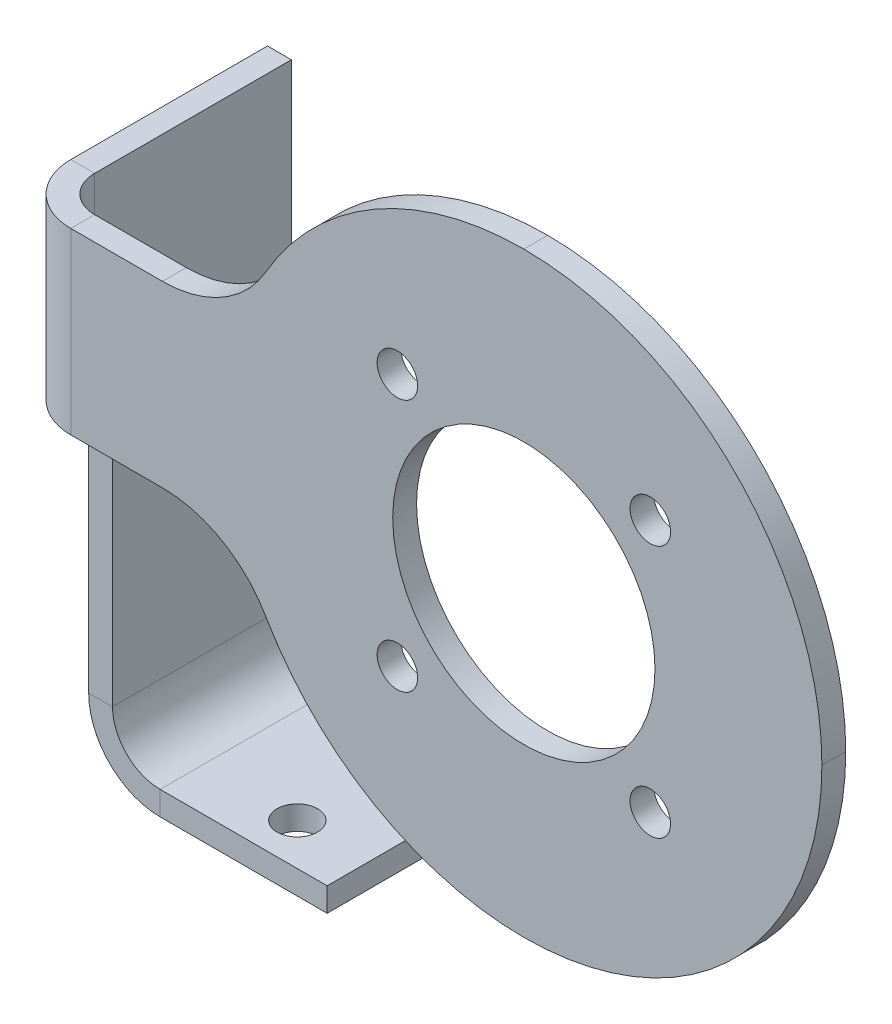
ISO-10303-21;
HEADER;
FILE_DESCRIPTION(('STEP AP214'),'2;1');
FILE_NAME('part.step','',(''),(''),'','','');
FILE_SCHEMA(('AUTOMOTIVE_DESIGN { 1 0 10303 214 1 1 1 1 }'));
ENDSEC;
DATA;
#1=APPLICATION_CONTEXT('core data for automotive mechanical design processes');
#2=APPLICATION_PROTOCOL_DEFINITION('international standard','automotive_design',2000,#1);
#3=PRODUCT_CONTEXT('',#1,'mechanical');
#4=PRODUCT('Part','Part','',(#3));
#5=PRODUCT_RELATED_PRODUCT_CATEGORY('part','',(#4));
#6=PRODUCT_DEFINITION_FORMATION('','',#4);
#7=PRODUCT_DEFINITION_CONTEXT('part definition',#1,'design');
#8=PRODUCT_DEFINITION('design','',#6,#7);
#9=PRODUCT_DEFINITION_SHAPE('','',#8);
#10=(LENGTH_UNIT() NAMED_UNIT(*) SI_UNIT(.MILLI.,.METRE.));
#11=(NAMED_UNIT(*) PLANE_ANGLE_UNIT() SI_UNIT($,.RADIAN.));
#12=(NAMED_UNIT(*) SI_UNIT($,.STERADIAN.) SOLID_ANGLE_UNIT());
#13=UNCERTAINTY_MEASURE_WITH_UNIT(LENGTH_MEASURE(1.E-05),#10,'distance_accuracy_value','');
#14=(GEOMETRIC_REPRESENTATION_CONTEXT(3) GLOBAL_UNCERTAINTY_ASSIGNED_CONTEXT((#13)) GLOBAL_UNIT_ASSIGNED_CONTEXT((#10,
#11,#12)) REPRESENTATION_CONTEXT('',''));
#15=CARTESIAN_POINT('',(0.,0.,0.));
#16=DIRECTION('',(0.,0.,1.));
#17=DIRECTION('',(1.,0.,0.));
#18=AXIS2_PLACEMENT_3D('',#15,#16,#17);
#19=CARTESIAN_POINT('',(-66.,32.5,-21.5));
#20=DIRECTION('',(0.,-1.,0.));
#21=DIRECTION('',(0.,0.,1.));
#22=AXIS2_PLACEMENT_3D('',#19,#20,#21);
#23=PLANE('',#22);
#24=DIRECTION('',(1.,0.,0.));
#25=VECTOR('',#24,1.);
#26=CARTESIAN_POINT('',(-66.,32.5,-21.5));
#27=LINE('',#26,#25);
#28=CARTESIAN_POINT('',(-68.,32.5,-21.5));
#29=VERTEX_POINT('',#28);
#30=CARTESIAN_POINT('',(-66.,32.5,-21.5));
#31=VERTEX_POINT('',#30);
#32=EDGE_CURVE('E14',#29,#31,#27,.T.);
#33=ORIENTED_EDGE('',*,*,#32,.F.);
#34=DIRECTION('',(0.,0.,1.));
#35=VECTOR('',#34,1.);
#36=CARTESIAN_POINT('',(-68.,32.5,-21.5));
#37=LINE('',#36,#35);
#38=CARTESIAN_POINT('',(-68.,32.5,-4.99999999999999));
#39=VERTEX_POINT('',#38);
#40=EDGE_CURVE('E141',#29,#39,#37,.T.);
#41=ORIENTED_EDGE('',*,*,#40,.T.);
#42=DIRECTION('',(1.,0.,0.));
#43=VECTOR('',#42,1.);
#44=CARTESIAN_POINT('',(-66.,32.5,-4.99999999999999));
#45=LINE('',#44,#43);
#46=CARTESIAN_POINT('',(-66.,32.5,-4.99999999999999));
#47=VERTEX_POINT('',#46);
#48=EDGE_CURVE('E69',#39,#47,#45,.T.);
#49=ORIENTED_EDGE('',*,*,#48,.T.);
#50=DIRECTION('',(0.,0.,1.));
#51=VECTOR('',#50,1.);
#52=CARTESIAN_POINT('',(-66.,32.5,-21.5));
#53=LINE('',#52,#51);
#54=EDGE_CURVE('E143',#31,#47,#53,.T.);
#55=ORIENTED_EDGE('',*,*,#54,.F.);
#56=EDGE_LOOP('',(#33,#41,#49,#55));
#57=FACE_BOUND('',#56,.T.);
#58=ADVANCED_FACE('F59',(#57),#23,.F.);
#59=CARTESIAN_POINT('',(-63.,32.5,-4.99999999999999));
#60=DIRECTION('',(0.,1.,0.));
#61=DIRECTION('',(0.,0.,1.));
#62=AXIS2_PLACEMENT_3D('',#59,#60,#61);
#63=PLANE('',#62);
#64=ORIENTED_EDGE('',*,*,#48,.F.);
#65=CARTESIAN_POINT('',(-63.,32.5,-4.99999999999999));
#66=DIRECTION('',(0.,-1.,0.));
#67=DIRECTION('',(0.,0.,-1.));
#68=AXIS2_PLACEMENT_3D('',#65,#66,#67);
#69=CIRCLE('',#68,5.);
#70=CARTESIAN_POINT('',(-63.,32.5,0.));
#71=VERTEX_POINT('',#70);
#72=EDGE_CURVE('E363',#39,#71,#69,.F.);
#73=ORIENTED_EDGE('',*,*,#72,.T.);
#74=DIRECTION('',(0.,0.,-1.));
#75=VECTOR('',#74,1.);
#76=CARTESIAN_POINT('',(-63.,32.5,-1.99999999999999));
#77=LINE('',#76,#75);
#78=CARTESIAN_POINT('',(-63.,32.5,-1.99999999999999));
#79=VERTEX_POINT('',#78);
#80=EDGE_CURVE('E230',#71,#79,#77,.T.);
#81=ORIENTED_EDGE('',*,*,#80,.T.);
#82=CARTESIAN_POINT('',(-63.,32.5,-4.99999999999999));
#83=DIRECTION('',(0.,-1.,0.));
#84=DIRECTION('',(0.,0.,-1.));
#85=AXIS2_PLACEMENT_3D('',#82,#83,#84);
#86=CIRCLE('',#85,3.);
#87=EDGE_CURVE('E249',#47,#79,#86,.F.);
#88=ORIENTED_EDGE('',*,*,#87,.F.);
#89=EDGE_LOOP('',(#64,#73,#81,#88));
#90=FACE_BOUND('',#89,.T.);
#91=ADVANCED_FACE('F250',(#90),#63,.T.);
#92=CARTESIAN_POINT('',(-63.,32.5,-2.));
#93=DIRECTION('',(0.,-1.,0.));
#94=DIRECTION('',(1.,0.,0.));
#95=AXIS2_PLACEMENT_3D('',#92,#93,#94);
#96=PLANE('',#95);
#97=ORIENTED_EDGE('',*,*,#80,.F.);
#98=DIRECTION('',(1.,0.,0.));
#99=VECTOR('',#98,1.);
#100=CARTESIAN_POINT('',(-63.,32.5,0.));
#101=LINE('',#100,#99);
#102=CARTESIAN_POINT('',(-55.3108891324554,32.5,0.));
#103=VERTEX_POINT('',#102);
#104=EDGE_CURVE('E342',#71,#103,#101,.T.);
#105=ORIENTED_EDGE('',*,*,#104,.T.);
#106=DIRECTION('',(0.,0.,-1.));
#107=VECTOR('',#106,1.);
#108=CARTESIAN_POINT('',(-55.3108891324554,32.5,-2.));
#109=LINE('',#108,#107);
#110=CARTESIAN_POINT('',(-55.3108891324554,32.5,-2.));
#111=VERTEX_POINT('',#110);
#112=EDGE_CURVE('E227',#103,#111,#109,.T.);
#113=ORIENTED_EDGE('',*,*,#112,.T.);
#114=DIRECTION('',(1.,0.,0.));
#115=VECTOR('',#114,1.);
#116=CARTESIAN_POINT('',(-63.,32.5,-2.));
#117=LINE('',#116,#115);
#118=EDGE_CURVE('E304',#79,#111,#117,.T.);
#119=ORIENTED_EDGE('',*,*,#118,.F.);
#120=EDGE_LOOP('',(#97,#105,#113,#119));
#121=FACE_BOUND('',#120,.T.);
#122=ADVANCED_FACE('F396',(#121),#96,.F.);
#123=CARTESIAN_POINT('',(-55.3108891324554,42.5,-2.));
#124=DIRECTION('',(0.,0.,1.));
#125=DIRECTION('',(1.,0.,0.));
#126=AXIS2_PLACEMENT_3D('',#123,#124,#125);
#127=CYLINDRICAL_SURFACE('',#126,10.);
#128=ORIENTED_EDGE('',*,*,#112,.F.);
#129=CARTESIAN_POINT('',(-55.3108891324554,42.5,0.));
#130=DIRECTION('',(0.,0.,1.));
#131=DIRECTION('',(1.,0.,0.));
#132=AXIS2_PLACEMENT_3D('',#129,#130,#131);
#133=CIRCLE('',#132,10.);
#134=CARTESIAN_POINT('',(-46.650635094611,37.5,0.));
#135=VERTEX_POINT('',#134);
#136=EDGE_CURVE('E380',#103,#135,#133,.T.);
#137=ORIENTED_EDGE('',*,*,#136,.T.);
#138=DIRECTION('',(0.,0.,-1.));
#139=VECTOR('',#138,1.);
#140=CARTESIAN_POINT('',(-46.650635094611,37.5,-2.));
#141=LINE('',#140,#139);
#142=CARTESIAN_POINT('',(-46.650635094611,37.5,-2.));
#143=VERTEX_POINT('',#142);
#144=EDGE_CURVE('E224',#135,#143,#141,.T.);
#145=ORIENTED_EDGE('',*,*,#144,.T.);
#146=CARTESIAN_POINT('',(-55.3108891324554,42.5,-2.));
#147=DIRECTION('',(0.,0.,1.));
#148=DIRECTION('',(1.,0.,0.));
#149=AXIS2_PLACEMENT_3D('',#146,#147,#148);
#150=CIRCLE('',#149,10.);
#151=EDGE_CURVE('E307',#111,#143,#150,.T.);
#152=ORIENTED_EDGE('',*,*,#151,.F.);
#153=EDGE_LOOP('',(#128,#137,#145,#152));
#154=FACE_BOUND('',#153,.T.);
#155=ADVANCED_FACE('F473',(#154),#127,.F.);
#156=CARTESIAN_POINT('',(-25.,25.,-2.));
#157=DIRECTION('',(0.,0.,1.));
#158=DIRECTION('',(1.,0.,0.));
#159=AXIS2_PLACEMENT_3D('',#156,#157,#158);
#160=CYLINDRICAL_SURFACE('',#159,25.);
#161=ORIENTED_EDGE('',*,*,#144,.F.);
#162=CARTESIAN_POINT('',(-25.,25.,0.));
#163=DIRECTION('',(0.,0.,1.));
#164=DIRECTION('',(1.,0.,0.));
#165=AXIS2_PLACEMENT_3D('',#162,#163,#164);
#166=CIRCLE('',#165,25.);
#167=CARTESIAN_POINT('',(-25.,50.,0.));
#168=VERTEX_POINT('',#167);
#169=EDGE_CURVE('E377',#135,#168,#166,.F.);
#170=ORIENTED_EDGE('',*,*,#169,.T.);
#171=DIRECTION('',(0.,0.,-1.));
#172=VECTOR('',#171,1.);
#173=CARTESIAN_POINT('',(-25.,50.,-2.));
#174=LINE('',#173,#172);
#175=CARTESIAN_POINT('',(-25.,50.,-2.));
#176=VERTEX_POINT('',#175);
#177=EDGE_CURVE('E221',#168,#176,#174,.T.);
#178=ORIENTED_EDGE('',*,*,#177,.T.);
#179=CARTESIAN_POINT('',(-25.,25.,-2.));
#180=DIRECTION('',(0.,0.,1.));
#181=DIRECTION('',(1.,0.,0.));
#182=AXIS2_PLACEMENT_3D('',#179,#180,#181);
#183=CIRCLE('',#182,25.);
#184=EDGE_CURVE('E256',#143,#176,#183,.F.);
#185=ORIENTED_EDGE('',*,*,#184,.F.);
#186=EDGE_LOOP('',(#161,#170,#178,#185));
#187=FACE_BOUND('',#186,.T.);
#188=ADVANCED_FACE('F471',(#187),#160,.T.);
#189=CARTESIAN_POINT('',(-25.,25.,-2.));
#190=DIRECTION('',(0.,0.,1.));
#191=DIRECTION('',(1.,0.,0.));
#192=AXIS2_PLACEMENT_3D('',#189,#190,#191);
#193=CYLINDRICAL_SURFACE('',#192,25.);
#194=ORIENTED_EDGE('',*,*,#177,.F.);
#195=CARTESIAN_POINT('',(-25.,25.,0.));
#196=DIRECTION('',(0.,0.,1.));
#197=DIRECTION('',(1.,0.,0.));
#198=AXIS2_PLACEMENT_3D('',#195,#196,#197);
#199=CIRCLE('',#198,25.);
#200=CARTESIAN_POINT('',(0.,25.,0.));
#201=VERTEX_POINT('',#200);
#202=EDGE_CURVE('E187',#168,#201,#199,.F.);
#203=ORIENTED_EDGE('',*,*,#202,.T.);
#204=DIRECTION('',(0.,0.,-1.));
#205=VECTOR('',#204,1.);
#206=CARTESIAN_POINT('',(0.,25.,-2.));
#207=LINE('',#206,#205);
#208=CARTESIAN_POINT('',(0.,25.,-2.));
#209=VERTEX_POINT('',#208);
#210=EDGE_CURVE('E218',#201,#209,#207,.T.);
#211=ORIENTED_EDGE('',*,*,#210,.T.);
#212=CARTESIAN_POINT('',(-25.,25.,-2.));
#213=DIRECTION('',(0.,0.,1.));
#214=DIRECTION('',(1.,0.,0.));
#215=AXIS2_PLACEMENT_3D('',#212,#213,#214);
#216=CIRCLE('',#215,25.);
#217=EDGE_CURVE('E287',#176,#209,#216,.F.);
#218=ORIENTED_EDGE('',*,*,#217,.F.);
#219=EDGE_LOOP('',(#194,#203,#211,#218));
#220=FACE_BOUND('',#219,.T.);
#221=ADVANCED_FACE('F468',(#220),#193,.T.);
#222=CARTESIAN_POINT('',(-25.,25.,-2.));
#223=DIRECTION('',(0.,0.,1.));
#224=DIRECTION('',(1.,0.,0.));
#225=AXIS2_PLACEMENT_3D('',#222,#223,#224);
#226=CYLINDRICAL_SURFACE('',#225,25.);
#227=ORIENTED_EDGE('',*,*,#210,.F.);
#228=CARTESIAN_POINT('',(-25.,25.,0.));
#229=DIRECTION('',(0.,0.,1.));
#230=DIRECTION('',(1.,0.,0.));
#231=AXIS2_PLACEMENT_3D('',#228,#229,#230);
#232=CIRCLE('',#231,25.);
#233=CARTESIAN_POINT('',(-25.,0.,0.));
#234=VERTEX_POINT('',#233);
#235=EDGE_CURVE('E372',#201,#234,#232,.F.);
#236=ORIENTED_EDGE('',*,*,#235,.T.);
#237=DIRECTION('',(0.,0.,-1.));
#238=VECTOR('',#237,1.);
#239=CARTESIAN_POINT('',(-25.,0.,-2.));
#240=LINE('',#239,#238);
#241=CARTESIAN_POINT('',(-25.,0.,-2.));
#242=VERTEX_POINT('',#241);
#243=EDGE_CURVE('E215',#234,#242,#240,.T.);
#244=ORIENTED_EDGE('',*,*,#243,.T.);
#245=CARTESIAN_POINT('',(-25.,25.,-2.));
#246=DIRECTION('',(0.,0.,1.));
#247=DIRECTION('',(1.,0.,0.));
#248=AXIS2_PLACEMENT_3D('',#245,#246,#247);
#249=CIRCLE('',#248,25.);
#250=EDGE_CURVE('E290',#209,#242,#249,.F.);
#251=ORIENTED_EDGE('',*,*,#250,.F.);
#252=EDGE_LOOP('',(#227,#236,#244,#251));
#253=FACE_BOUND('',#252,.T.);
#254=ADVANCED_FACE('F465',(#253),#226,.T.);
#255=CARTESIAN_POINT('',(-25.,25.,-2.));
#256=DIRECTION('',(0.,0.,1.));
#257=DIRECTION('',(1.,0.,0.));
#258=AXIS2_PLACEMENT_3D('',#255,#256,#257);
#259=CYLINDRICAL_SURFACE('',#258,25.);
#260=ORIENTED_EDGE('',*,*,#243,.F.);
#261=CARTESIAN_POINT('',(-25.,25.,0.));
#262=DIRECTION('',(0.,0.,1.));
#263=DIRECTION('',(1.,0.,0.));
#264=AXIS2_PLACEMENT_3D('',#261,#262,#263);
#265=CIRCLE('',#264,25.);
#266=CARTESIAN_POINT('',(-46.650635094611,12.5,0.));
#267=VERTEX_POINT('',#266);
#268=EDGE_CURVE('E369',#234,#267,#265,.F.);
#269=ORIENTED_EDGE('',*,*,#268,.T.);
#270=DIRECTION('',(0.,0.,-1.));
#271=VECTOR('',#270,1.);
#272=CARTESIAN_POINT('',(-46.650635094611,12.5,-2.));
#273=LINE('',#272,#271);
#274=CARTESIAN_POINT('',(-46.650635094611,12.5,-2.));
#275=VERTEX_POINT('',#274);
#276=EDGE_CURVE('E212',#267,#275,#273,.T.);
#277=ORIENTED_EDGE('',*,*,#276,.T.);
#278=CARTESIAN_POINT('',(-25.,25.,-2.));
#279=DIRECTION('',(0.,0.,1.));
#280=DIRECTION('',(1.,0.,0.));
#281=AXIS2_PLACEMENT_3D('',#278,#279,#280);
#282=CIRCLE('',#281,25.);
#283=EDGE_CURVE('E293',#242,#275,#282,.F.);
#284=ORIENTED_EDGE('',*,*,#283,.F.);
#285=EDGE_LOOP('',(#260,#269,#277,#284));
#286=FACE_BOUND('',#285,.T.);
#287=ADVANCED_FACE('F455',(#286),#259,.T.);
#288=CARTESIAN_POINT('',(-55.3108891324554,7.5,-2.));
#289=DIRECTION('',(0.,0.,1.));
#290=DIRECTION('',(1.,0.,0.));
#291=AXIS2_PLACEMENT_3D('',#288,#289,#290);
#292=CYLINDRICAL_SURFACE('',#291,10.);
#293=ORIENTED_EDGE('',*,*,#276,.F.);
#294=CARTESIAN_POINT('',(-55.3108891324554,7.5,0.));
#295=DIRECTION('',(0.,0.,1.));
#296=DIRECTION('',(1.,0.,0.));
#297=AXIS2_PLACEMENT_3D('',#294,#295,#296);
#298=CIRCLE('',#297,10.);
#299=CARTESIAN_POINT('',(-55.3108891324554,17.5,0.));
#300=VERTEX_POINT('',#299);
#301=EDGE_CURVE('E366',#267,#300,#298,.T.);
#302=ORIENTED_EDGE('',*,*,#301,.T.);
#303=DIRECTION('',(0.,0.,-1.));
#304=VECTOR('',#303,1.);
#305=CARTESIAN_POINT('',(-55.3108891324554,17.5,-2.));
#306=LINE('',#305,#304);
#307=CARTESIAN_POINT('',(-55.3108891324554,17.5,-2.));
#308=VERTEX_POINT('',#307);
#309=EDGE_CURVE('E209',#300,#308,#306,.T.);
#310=ORIENTED_EDGE('',*,*,#309,.T.);
#311=CARTESIAN_POINT('',(-55.3108891324554,7.5,-2.));
#312=DIRECTION('',(0.,0.,1.));
#313=DIRECTION('',(1.,0.,0.));
#314=AXIS2_PLACEMENT_3D('',#311,#312,#313);
#315=CIRCLE('',#314,10.);
#316=EDGE_CURVE('E296',#275,#308,#315,.T.);
#317=ORIENTED_EDGE('',*,*,#316,.F.);
#318=EDGE_LOOP('',(#293,#302,#310,#317));
#319=FACE_BOUND('',#318,.T.);
#320=ADVANCED_FACE('F461',(#319),#292,.F.);
#321=CARTESIAN_POINT('',(-63.,17.5,-2.));
#322=DIRECTION('',(0.,1.,0.));
#323=DIRECTION('',(-1.,0.,0.));
#324=AXIS2_PLACEMENT_3D('',#321,#322,#323);
#325=PLANE('',#324);
#326=ORIENTED_EDGE('',*,*,#309,.F.);
#327=DIRECTION('',(1.,0.,0.));
#328=VECTOR('',#327,1.);
#329=CARTESIAN_POINT('',(-63.,17.5,0.));
#330=LINE('',#329,#328);
#331=CARTESIAN_POINT('',(-63.,17.5,0.));
#332=VERTEX_POINT('',#331);
#333=EDGE_CURVE('E343',#300,#332,#330,.F.);
#334=ORIENTED_EDGE('',*,*,#333,.T.);
#335=DIRECTION('',(0.,0.,-1.));
#336=VECTOR('',#335,1.);
#337=CARTESIAN_POINT('',(-63.,17.5,-1.99999999999999));
#338=LINE('',#337,#336);
#339=CARTESIAN_POINT('',(-63.,17.5,-1.99999999999999));
#340=VERTEX_POINT('',#339);
#341=EDGE_CURVE('E206',#332,#340,#338,.T.);
#342=ORIENTED_EDGE('',*,*,#341,.T.);
#343=DIRECTION('',(-1.,0.,0.));
#344=VECTOR('',#343,1.);
#345=CARTESIAN_POINT('',(-63.,17.5,-2.));
#346=LINE('',#345,#344);
#347=EDGE_CURVE('E299',#308,#340,#346,.T.);
#348=ORIENTED_EDGE('',*,*,#347,.F.);
#349=EDGE_LOOP('',(#326,#334,#342,#348));
#350=FACE_BOUND('',#349,.T.);
#351=ADVANCED_FACE('F462',(#350),#325,.F.);
#352=CARTESIAN_POINT('',(-63.,17.5,-4.99999999999999));
#353=DIRECTION('',(0.,-1.,0.));
#354=DIRECTION('',(0.,0.,-1.));
#355=AXIS2_PLACEMENT_3D('',#352,#353,#354);
#356=PLANE('',#355);
#357=ORIENTED_EDGE('',*,*,#341,.F.);
#358=CARTESIAN_POINT('',(-63.,17.5,-4.99999999999999));
#359=DIRECTION('',(0.,-1.,0.));
#360=DIRECTION('',(0.,0.,-1.));
#361=AXIS2_PLACEMENT_3D('',#358,#359,#360);
#362=CIRCLE('',#361,5.);
#363=CARTESIAN_POINT('',(-68.,17.5,-4.99999999999999));
#364=VERTEX_POINT('',#363);
#365=EDGE_CURVE('E351',#332,#364,#362,.T.);
#366=ORIENTED_EDGE('',*,*,#365,.T.);
#367=DIRECTION('',(1.,0.,0.));
#368=VECTOR('',#367,1.);
#369=CARTESIAN_POINT('',(-66.,17.5,-4.99999999999999));
#370=LINE('',#369,#368);
#371=CARTESIAN_POINT('',(-66.,17.5,-4.99999999999999));
#372=VERTEX_POINT('',#371);
#373=EDGE_CURVE('E203',#364,#372,#370,.T.);
#374=ORIENTED_EDGE('',*,*,#373,.T.);
#375=CARTESIAN_POINT('',(-63.,17.5,-4.99999999999999));
#376=DIRECTION('',(0.,1.,0.));
#377=DIRECTION('',(0.,0.,1.));
#378=AXIS2_PLACEMENT_3D('',#375,#376,#377);
#379=CIRCLE('',#378,3.);
#380=EDGE_CURVE('E255',#340,#372,#379,.F.);
#381=ORIENTED_EDGE('',*,*,#380,.F.);
#382=EDGE_LOOP('',(#357,#366,#374,#381));
#383=FACE_BOUND('',#382,.T.);
#384=ADVANCED_FACE('F548',(#383),#356,.T.);
#385=CARTESIAN_POINT('',(-66.,17.5,-21.5));
#386=DIRECTION('',(0.,1.,0.));
#387=DIRECTION('',(0.,0.,-1.));
#388=AXIS2_PLACEMENT_3D('',#385,#386,#387);
#389=PLANE('',#388);
#390=ORIENTED_EDGE('',*,*,#373,.F.);
#391=DIRECTION('',(0.,0.,1.));
#392=VECTOR('',#391,1.);
#393=CARTESIAN_POINT('',(-68.,17.5,-21.5));
#394=LINE('',#393,#392);
#395=CARTESIAN_POINT('',(-68.,17.5,-6.5));
#396=VERTEX_POINT('',#395);
#397=EDGE_CURVE('E338',#364,#396,#394,.F.);
#398=ORIENTED_EDGE('',*,*,#397,.T.);
#399=DIRECTION('',(1.,0.,0.));
#400=VECTOR('',#399,1.);
#401=CARTESIAN_POINT('',(-66.,17.5,-6.5));
#402=LINE('',#401,#400);
#403=CARTESIAN_POINT('',(-66.,17.5,-6.5));
#404=VERTEX_POINT('',#403);
#405=EDGE_CURVE('E200',#396,#404,#402,.T.);
#406=ORIENTED_EDGE('',*,*,#405,.T.);
#407=DIRECTION('',(0.,0.,-1.));
#408=VECTOR('',#407,1.);
#409=CARTESIAN_POINT('',(-66.,17.5,-21.5));
#410=LINE('',#409,#408);
#411=EDGE_CURVE('E262',#372,#404,#410,.T.);
#412=ORIENTED_EDGE('',*,*,#411,.F.);
#413=EDGE_LOOP('',(#390,#398,#406,#412));
#414=FACE_BOUND('',#413,.T.);
#415=ADVANCED_FACE('F545',(#414),#389,.F.);
#416=CARTESIAN_POINT('',(-66.,0.,-6.5));
#417=DIRECTION('',(0.,0.,-1.));
#418=DIRECTION('',(0.,-1.,0.));
#419=AXIS2_PLACEMENT_3D('',#416,#417,#418);
#420=PLANE('',#419);
#421=ORIENTED_EDGE('',*,*,#405,.F.);
#422=DIRECTION('',(0.,1.,0.));
#423=VECTOR('',#422,1.);
#424=CARTESIAN_POINT('',(-68.,50.,-6.5));
#425=LINE('',#424,#423);
#426=CARTESIAN_POINT('',(-68.,-6.99999999999999,-6.5));
#427=VERTEX_POINT('',#426);
#428=EDGE_CURVE('E331',#396,#427,#425,.F.);
#429=ORIENTED_EDGE('',*,*,#428,.T.);
#430=DIRECTION('',(1.,0.,0.));
#431=VECTOR('',#430,1.);
#432=CARTESIAN_POINT('',(-66.,-6.99999999999999,-6.5));
#433=LINE('',#432,#431);
#434=CARTESIAN_POINT('',(-66.,-6.99999999999999,-6.5));
#435=VERTEX_POINT('',#434);
#436=EDGE_CURVE('E197',#427,#435,#433,.T.);
#437=ORIENTED_EDGE('',*,*,#436,.T.);
#438=DIRECTION('',(0.,-1.,0.));
#439=VECTOR('',#438,1.);
#440=CARTESIAN_POINT('',(-66.,0.,-6.5));
#441=LINE('',#440,#439);
#442=EDGE_CURVE('E264',#404,#435,#441,.T.);
#443=ORIENTED_EDGE('',*,*,#442,.F.);
#444=EDGE_LOOP('',(#421,#429,#437,#443));
#445=FACE_BOUND('',#444,.T.);
#446=ADVANCED_FACE('F445',(#445),#420,.F.);
#447=CARTESIAN_POINT('',(-62.,-6.99999999999999,-6.5));
#448=DIRECTION('',(0.,0.,-1.));
#449=DIRECTION('',(-1.,0.,0.));
#450=AXIS2_PLACEMENT_3D('',#447,#448,#449);
#451=PLANE('',#450);
#452=ORIENTED_EDGE('',*,*,#436,.F.);
#453=CARTESIAN_POINT('',(-62.,-6.99999999999999,-6.5));
#454=DIRECTION('',(0.,0.,-1.));
#455=DIRECTION('',(-1.,0.,0.));
#456=AXIS2_PLACEMENT_3D('',#453,#454,#455);
#457=CIRCLE('',#456,5.99999999999999);
#458=CARTESIAN_POINT('',(-62.,-13.,-6.5));
#459=VERTEX_POINT('',#458);
#460=EDGE_CURVE('E347',#427,#459,#457,.F.);
#461=ORIENTED_EDGE('',*,*,#460,.T.);
#462=DIRECTION('',(0.,1.,0.));
#463=VECTOR('',#462,1.);
#464=CARTESIAN_POINT('',(-62.,-11.,-6.5));
#465=LINE('',#464,#463);
#466=CARTESIAN_POINT('',(-62.,-11.,-6.5));
#467=VERTEX_POINT('',#466);
#468=EDGE_CURVE('E194',#459,#467,#465,.T.);
#469=ORIENTED_EDGE('',*,*,#468,.T.);
#470=CARTESIAN_POINT('',(-62.,-6.99999999999999,-6.5));
#471=DIRECTION('',(0.,0.,1.));
#472=DIRECTION('',(1.,0.,0.));
#473=AXIS2_PLACEMENT_3D('',#470,#471,#472);
#474=CIRCLE('',#473,3.99999999999999);
#475=EDGE_CURVE('E327',#435,#467,#474,.T.);
#476=ORIENTED_EDGE('',*,*,#475,.F.);
#477=EDGE_LOOP('',(#452,#461,#469,#476));
#478=FACE_BOUND('',#477,.T.);
#479=ADVANCED_FACE('F421',(#478),#451,.F.);
#480=CARTESIAN_POINT('',(-62.,-11.,-6.5));
#481=DIRECTION('',(0.,0.,1.));
#482=DIRECTION('',(1.,0.,0.));
#483=AXIS2_PLACEMENT_3D('',#480,#481,#482);
#484=PLANE('',#483);
#485=ORIENTED_EDGE('',*,*,#468,.F.);
#486=DIRECTION('',(-1.,0.,0.));
#487=VECTOR('',#486,1.);
#488=CARTESIAN_POINT('',(-62.,-13.,-6.5));
#489=LINE('',#488,#487);
#490=CARTESIAN_POINT('',(-48.,-13.,-6.5));
#491=VERTEX_POINT('',#490);
#492=EDGE_CURVE('E335',#459,#491,#489,.F.);
#493=ORIENTED_EDGE('',*,*,#492,.T.);
#494=DIRECTION('',(0.,1.,0.));
#495=VECTOR('',#494,1.);
#496=CARTESIAN_POINT('',(-48.,-11.,-6.5));
#497=LINE('',#496,#495);
#498=CARTESIAN_POINT('',(-48.,-11.,-6.5));
#499=VERTEX_POINT('',#498);
#500=EDGE_CURVE('E192',#491,#499,#497,.T.);
#501=ORIENTED_EDGE('',*,*,#500,.T.);
#502=DIRECTION('',(1.,0.,0.));
#503=VECTOR('',#502,1.);
#504=CARTESIAN_POINT('',(-62.,-11.,-6.5));
#505=LINE('',#504,#503);
#506=EDGE_CURVE('E319',#467,#499,#505,.T.);
#507=ORIENTED_EDGE('',*,*,#506,.F.);
#508=EDGE_LOOP('',(#485,#493,#501,#507));
#509=FACE_BOUND('',#508,.T.);
#510=ADVANCED_FACE('F427',(#509),#484,.T.);
#511=CARTESIAN_POINT('',(-48.,-11.,-6.5));
#512=DIRECTION('',(1.,0.,0.));
#513=DIRECTION('',(0.,0.,-1.));
#514=AXIS2_PLACEMENT_3D('',#511,#512,#513);
#515=PLANE('',#514);
#516=ORIENTED_EDGE('',*,*,#500,.F.);
#517=DIRECTION('',(0.,0.,1.));
#518=VECTOR('',#517,1.);
#519=CARTESIAN_POINT('',(-48.,-13.,-6.5));
#520=LINE('',#519,#518);
#521=CARTESIAN_POINT('',(-48.,-13.,-21.5));
#522=VERTEX_POINT('',#521);
#523=EDGE_CURVE('E348',#491,#522,#520,.F.);
#524=ORIENTED_EDGE('',*,*,#523,.T.);
#525=DIRECTION('',(0.,1.,0.));
#526=VECTOR('',#525,1.);
#527=CARTESIAN_POINT('',(-48.,-11.,-21.5));
#528=LINE('',#527,#526);
#529=CARTESIAN_POINT('',(-48.,-11.,-21.5));
#530=VERTEX_POINT('',#529);
#531=EDGE_CURVE('E77',#522,#530,#528,.T.);
#532=ORIENTED_EDGE('',*,*,#531,.T.);
#533=DIRECTION('',(0.,0.,-1.));
#534=VECTOR('',#533,1.);
#535=CARTESIAN_POINT('',(-48.,-11.,-6.5));
#536=LINE('',#535,#534);
#537=EDGE_CURVE('E322',#499,#530,#536,.T.);
#538=ORIENTED_EDGE('',*,*,#537,.F.);
#539=EDGE_LOOP('',(#516,#524,#532,#538));
#540=FACE_BOUND('',#539,.T.);
#541=ADVANCED_FACE('F536',(#540),#515,.T.);
#542=CARTESIAN_POINT('',(-62.,-11.,-21.5));
#543=DIRECTION('',(0.,0.,1.));
#544=DIRECTION('',(1.,0.,0.));
#545=AXIS2_PLACEMENT_3D('',#542,#543,#544);
#546=PLANE('',#545);
#547=ORIENTED_EDGE('',*,*,#531,.F.);
#548=DIRECTION('',(-1.,0.,0.));
#549=VECTOR('',#548,1.);
#550=CARTESIAN_POINT('',(-62.,-13.,-21.5));
#551=LINE('',#550,#549);
#552=CARTESIAN_POINT('',(-62.,-13.,-21.5));
#553=VERTEX_POINT('',#552);
#554=EDGE_CURVE('E336',#553,#522,#551,.F.);
#555=ORIENTED_EDGE('',*,*,#554,.F.);
#556=DIRECTION('',(0.,1.,0.));
#557=VECTOR('',#556,1.);
#558=CARTESIAN_POINT('',(-62.,-11.,-21.5));
#559=LINE('',#558,#557);
#560=CARTESIAN_POINT('',(-62.,-11.,-21.5));
#561=VERTEX_POINT('',#560);
#562=EDGE_CURVE('E188',#553,#561,#559,.T.);
#563=ORIENTED_EDGE('',*,*,#562,.T.);
#564=DIRECTION('',(1.,0.,0.));
#565=VECTOR('',#564,1.);
#566=CARTESIAN_POINT('',(-62.,-11.,-21.5));
#567=LINE('',#566,#565);
#568=EDGE_CURVE('E313',#561,#530,#567,.T.);
#569=ORIENTED_EDGE('',*,*,#568,.T.);
#570=EDGE_LOOP('',(#547,#555,#563,#569));
#571=FACE_BOUND('',#570,.T.);
#572=ADVANCED_FACE('F533',(#571),#546,.F.);
#573=CARTESIAN_POINT('',(-62.,-6.99999999999999,-21.5));
#574=DIRECTION('',(0.,0.,-1.));
#575=DIRECTION('',(-1.,0.,0.));
#576=AXIS2_PLACEMENT_3D('',#573,#574,#575);
#577=PLANE('',#576);
#578=ORIENTED_EDGE('',*,*,#562,.F.);
#579=CARTESIAN_POINT('',(-62.,-6.99999999999999,-21.5));
#580=DIRECTION('',(0.,0.,-1.));
#581=DIRECTION('',(-1.,0.,0.));
#582=AXIS2_PLACEMENT_3D('',#579,#580,#581);
#583=CIRCLE('',#582,5.99999999999999);
#584=CARTESIAN_POINT('',(-68.,-6.99999999999999,-21.5));
#585=VERTEX_POINT('',#584);
#586=EDGE_CURVE('E344',#585,#553,#583,.F.);
#587=ORIENTED_EDGE('',*,*,#586,.F.);
#588=DIRECTION('',(1.,0.,0.));
#589=VECTOR('',#588,1.);
#590=CARTESIAN_POINT('',(-66.,-6.99999999999999,-21.5));
#591=LINE('',#590,#589);
#592=CARTESIAN_POINT('',(-66.,-6.99999999999999,-21.5));
#593=VERTEX_POINT('',#592);
#594=EDGE_CURVE('E63',#585,#593,#591,.T.);
#595=ORIENTED_EDGE('',*,*,#594,.T.);
#596=CARTESIAN_POINT('',(-62.,-6.99999999999999,-21.5));
#597=DIRECTION('',(0.,0.,1.));
#598=DIRECTION('',(1.,0.,0.));
#599=AXIS2_PLACEMENT_3D('',#596,#597,#598);
#600=CIRCLE('',#599,3.99999999999999);
#601=EDGE_CURVE('E324',#593,#561,#600,.T.);
#602=ORIENTED_EDGE('',*,*,#601,.T.);
#603=EDGE_LOOP('',(#578,#587,#595,#602));
#604=FACE_BOUND('',#603,.T.);
#605=ADVANCED_FACE('F437',(#604),#577,.T.);
#606=CARTESIAN_POINT('',(-35.6066017177982,35.6066017177983,-2.));
#607=DIRECTION('',(0.,0.,1.));
#608=DIRECTION('',(1.,0.,0.));
#609=AXIS2_PLACEMENT_3D('',#606,#607,#608);
#610=CYLINDRICAL_SURFACE('',#609,1.69999999999999);
#611=CARTESIAN_POINT('',(-35.6066017177982,35.6066017177983,-2.));
#612=DIRECTION('',(0.,0.,1.));
#613=DIRECTION('',(1.,0.,0.));
#614=AXIS2_PLACEMENT_3D('',#611,#612,#613);
#615=CIRCLE('',#614,1.69999999999999);
#616=CARTESIAN_POINT('',(-33.9066017177982,35.6066017177983,-2.));
#617=VERTEX_POINT('',#616);
#618=EDGE_CURVE('E272',#617,#617,#615,.T.);
#619=ORIENTED_EDGE('',*,*,#618,.F.);
#620=EDGE_LOOP('',(#619));
#621=FACE_BOUND('',#620,.T.);
#622=CARTESIAN_POINT('',(-35.6066017177982,35.6066017177983,0.));
#623=DIRECTION('',(0.,0.,1.));
#624=DIRECTION('',(1.,0.,0.));
#625=AXIS2_PLACEMENT_3D('',#622,#623,#624);
#626=CIRCLE('',#625,1.69999999999999);
#627=CARTESIAN_POINT('',(-33.9066017177982,35.6066017177983,0.));
#628=VERTEX_POINT('',#627);
#629=EDGE_CURVE('E171',#628,#628,#626,.T.);
#630=ORIENTED_EDGE('',*,*,#629,.T.);
#631=EDGE_LOOP('',(#630));
#632=FACE_BOUND('',#631,.T.);
#633=ADVANCED_FACE('F491',(#621,#632),#610,.F.);
#634=CARTESIAN_POINT('',(-14.3933982822018,35.6066017177982,-2.));
#635=DIRECTION('',(0.,0.,1.));
#636=DIRECTION('',(1.,0.,0.));
#637=AXIS2_PLACEMENT_3D('',#634,#635,#636);
#638=CYLINDRICAL_SURFACE('',#637,1.69999999999999);
#639=CARTESIAN_POINT('',(-14.3933982822018,35.6066017177982,-2.));
#640=DIRECTION('',(0.,0.,1.));
#641=DIRECTION('',(1.,0.,0.));
#642=AXIS2_PLACEMENT_3D('',#639,#640,#641);
#643=CIRCLE('',#642,1.69999999999999);
#644=CARTESIAN_POINT('',(-12.6933982822018,35.6066017177982,-2.));
#645=VERTEX_POINT('',#644);
#646=EDGE_CURVE('E275',#645,#645,#643,.T.);
#647=ORIENTED_EDGE('',*,*,#646,.F.);
#648=EDGE_LOOP('',(#647));
#649=FACE_BOUND('',#648,.T.);
#650=CARTESIAN_POINT('',(-14.3933982822018,35.6066017177982,0.));
#651=DIRECTION('',(0.,0.,1.));
#652=DIRECTION('',(1.,0.,0.));
#653=AXIS2_PLACEMENT_3D('',#650,#651,#652);
#654=CIRCLE('',#653,1.69999999999999);
#655=CARTESIAN_POINT('',(-12.6933982822018,35.6066017177982,0.));
#656=VERTEX_POINT('',#655);
#657=EDGE_CURVE('E174',#656,#656,#654,.T.);
#658=ORIENTED_EDGE('',*,*,#657,.T.);
#659=EDGE_LOOP('',(#658));
#660=FACE_BOUND('',#659,.T.);
#661=ADVANCED_FACE('F494',(#649,#660),#638,.F.);
#662=CARTESIAN_POINT('',(-14.3933982822018,14.3933982822017,-2.));
#663=DIRECTION('',(0.,0.,1.));
#664=DIRECTION('',(1.,0.,0.));
#665=AXIS2_PLACEMENT_3D('',#662,#663,#664);
#666=CYLINDRICAL_SURFACE('',#665,1.69999999999999);
#667=CARTESIAN_POINT('',(-14.3933982822018,14.3933982822017,-2.));
#668=DIRECTION('',(0.,0.,1.));
#669=DIRECTION('',(1.,0.,0.));
#670=AXIS2_PLACEMENT_3D('',#667,#668,#669);
#671=CIRCLE('',#670,1.69999999999999);
#672=CARTESIAN_POINT('',(-12.6933982822018,14.3933982822017,-2.));
#673=VERTEX_POINT('',#672);
#674=EDGE_CURVE('E278',#673,#673,#671,.T.);
#675=ORIENTED_EDGE('',*,*,#674,.F.);
#676=EDGE_LOOP('',(#675));
#677=FACE_BOUND('',#676,.T.);
#678=CARTESIAN_POINT('',(-14.3933982822018,14.3933982822017,0.));
#679=DIRECTION('',(0.,0.,1.));
#680=DIRECTION('',(1.,0.,0.));
#681=AXIS2_PLACEMENT_3D('',#678,#679,#680);
#682=CIRCLE('',#681,1.69999999999999);
#683=CARTESIAN_POINT('',(-12.6933982822018,14.3933982822017,0.));
#684=VERTEX_POINT('',#683);
#685=EDGE_CURVE('E178',#684,#684,#682,.T.);
#686=ORIENTED_EDGE('',*,*,#685,.T.);
#687=EDGE_LOOP('',(#686));
#688=FACE_BOUND('',#687,.T.);
#689=ADVANCED_FACE('F498',(#677,#688),#666,.F.);
#690=CARTESIAN_POINT('',(-35.6066017177982,14.3933982822018,-2.));
#691=DIRECTION('',(0.,0.,1.));
#692=DIRECTION('',(1.,0.,0.));
#693=AXIS2_PLACEMENT_3D('',#690,#691,#692);
#694=CYLINDRICAL_SURFACE('',#693,1.69999999999999);
#695=CARTESIAN_POINT('',(-35.6066017177982,14.3933982822018,-2.));
#696=DIRECTION('',(0.,0.,1.));
#697=DIRECTION('',(1.,0.,0.));
#698=AXIS2_PLACEMENT_3D('',#695,#696,#697);
#699=CIRCLE('',#698,1.69999999999999);
#700=CARTESIAN_POINT('',(-33.9066017177982,14.3933982822018,-2.));
#701=VERTEX_POINT('',#700);
#702=EDGE_CURVE('E281',#701,#701,#699,.T.);
#703=ORIENTED_EDGE('',*,*,#702,.F.);
#704=EDGE_LOOP('',(#703));
#705=FACE_BOUND('',#704,.T.);
#706=CARTESIAN_POINT('',(-35.6066017177982,14.3933982822018,0.));
#707=DIRECTION('',(0.,0.,1.));
#708=DIRECTION('',(1.,0.,0.));
#709=AXIS2_PLACEMENT_3D('',#706,#707,#708);
#710=CIRCLE('',#709,1.69999999999999);
#711=CARTESIAN_POINT('',(-33.9066017177982,14.3933982822018,0.));
#712=VERTEX_POINT('',#711);
#713=EDGE_CURVE('E181',#712,#712,#710,.T.);
#714=ORIENTED_EDGE('',*,*,#713,.T.);
#715=EDGE_LOOP('',(#714));
#716=FACE_BOUND('',#715,.T.);
#717=ADVANCED_FACE('F501',(#705,#716),#694,.F.);
#718=CARTESIAN_POINT('',(-25.,25.,-2.));
#719=DIRECTION('',(0.,0.,1.));
#720=DIRECTION('',(1.,0.,0.));
#721=AXIS2_PLACEMENT_3D('',#718,#719,#720);
#722=CYLINDRICAL_SURFACE('',#721,11.);
#723=CARTESIAN_POINT('',(-25.,25.,-2.));
#724=DIRECTION('',(0.,0.,1.));
#725=DIRECTION('',(1.,0.,0.));
#726=AXIS2_PLACEMENT_3D('',#723,#724,#725);
#727=CIRCLE('',#726,11.);
#728=CARTESIAN_POINT('',(-14.,25.,-2.));
#729=VERTEX_POINT('',#728);
#730=EDGE_CURVE('E284',#729,#729,#727,.T.);
#731=ORIENTED_EDGE('',*,*,#730,.F.);
#732=EDGE_LOOP('',(#731));
#733=FACE_BOUND('',#732,.T.);
#734=CARTESIAN_POINT('',(-25.,25.,0.));
#735=DIRECTION('',(0.,0.,1.));
#736=DIRECTION('',(1.,0.,0.));
#737=AXIS2_PLACEMENT_3D('',#734,#735,#736);
#738=CIRCLE('',#737,11.);
#739=CARTESIAN_POINT('',(-14.,25.,0.));
#740=VERTEX_POINT('',#739);
#741=EDGE_CURVE('E184',#740,#740,#738,.T.);
#742=ORIENTED_EDGE('',*,*,#741,.T.);
#743=EDGE_LOOP('',(#742));
#744=FACE_BOUND('',#743,.T.);
#745=ADVANCED_FACE('F61',(#733,#744),#722,.F.);
#746=CARTESIAN_POINT('',(-66.,50.,-21.5));
#747=DIRECTION('',(0.,0.,-1.));
#748=DIRECTION('',(0.,-1.,0.));
#749=AXIS2_PLACEMENT_3D('',#746,#747,#748);
#750=PLANE('',#749);
#751=DIRECTION('',(0.,1.,0.));
#752=VECTOR('',#751,1.);
#753=CARTESIAN_POINT('',(-68.,50.,-21.5));
#754=LINE('',#753,#752);
#755=EDGE_CURVE('E153',#29,#585,#754,.F.);
#756=ORIENTED_EDGE('',*,*,#755,.F.);
#757=ORIENTED_EDGE('',*,*,#32,.T.);
#758=DIRECTION('',(0.,-1.,0.));
#759=VECTOR('',#758,1.);
#760=CARTESIAN_POINT('',(-66.,50.,-21.5));
#761=LINE('',#760,#759);
#762=EDGE_CURVE('E246',#31,#593,#761,.T.);
#763=ORIENTED_EDGE('',*,*,#762,.T.);
#764=ORIENTED_EDGE('',*,*,#594,.F.);
#765=EDGE_LOOP('',(#756,#757,#763,#764));
#766=FACE_BOUND('',#765,.T.);
#767=ADVANCED_FACE('F161',(#766),#750,.T.);
#768=CARTESIAN_POINT('',(-62.,-6.99999999999999,-6.5));
#769=DIRECTION('',(0.,0.,-1.));
#770=DIRECTION('',(-1.,0.,0.));
#771=AXIS2_PLACEMENT_3D('',#768,#769,#770);
#772=CYLINDRICAL_SURFACE('',#771,3.99999999999999);
#773=ORIENTED_EDGE('',*,*,#601,.F.);
#774=DIRECTION('',(0.,0.,-1.));
#775=VECTOR('',#774,1.);
#776=CARTESIAN_POINT('',(-66.,-6.99999999999999,-6.5));
#777=LINE('',#776,#775);
#778=EDGE_CURVE('E270',#435,#593,#777,.T.);
#779=ORIENTED_EDGE('',*,*,#778,.F.);
#780=ORIENTED_EDGE('',*,*,#475,.T.);
#781=DIRECTION('',(0.,0.,-1.));
#782=VECTOR('',#781,1.);
#783=CARTESIAN_POINT('',(-62.,-11.,-6.5));
#784=LINE('',#783,#782);
#785=EDGE_CURVE('E316',#467,#561,#784,.T.);
#786=ORIENTED_EDGE('',*,*,#785,.T.);
#787=EDGE_LOOP('',(#773,#779,#780,#786));
#788=FACE_BOUND('',#787,.T.);
#789=ADVANCED_FACE('F432',(#788),#772,.F.);
#790=CARTESIAN_POINT('',(-62.,-11.,-6.5));
#791=DIRECTION('',(0.,1.,0.));
#792=DIRECTION('',(-1.,0.,0.));
#793=AXIS2_PLACEMENT_3D('',#790,#791,#792);
#794=PLANE('',#793);
#795=CARTESIAN_POINT('',(-54.,-11.,-10.));
#796=DIRECTION('',(0.,1.,0.));
#797=DIRECTION('',(0.,0.,1.));
#798=AXIS2_PLACEMENT_3D('',#795,#796,#797);
#799=CIRCLE('',#798,1.7);
#800=CARTESIAN_POINT('',(-54.,-11.,-8.3));
#801=VERTEX_POINT('',#800);
#802=EDGE_CURVE('E942',#801,#801,#799,.T.);
#803=ORIENTED_EDGE('',*,*,#802,.F.);
#804=EDGE_LOOP('',(#803));
#805=FACE_BOUND('',#804,.T.);
#806=CARTESIAN_POINT('',(-54.,-11.,-18.));
#807=DIRECTION('',(0.,1.,0.));
#808=DIRECTION('',(0.,0.,1.));
#809=AXIS2_PLACEMENT_3D('',#806,#807,#808);
#810=CIRCLE('',#809,1.7);
#811=CARTESIAN_POINT('',(-54.,-11.,-16.3));
#812=VERTEX_POINT('',#811);
#813=EDGE_CURVE('E167',#812,#812,#810,.T.);
#814=ORIENTED_EDGE('',*,*,#813,.F.);
#815=EDGE_LOOP('',(#814));
#816=FACE_BOUND('',#815,.T.);
#817=ORIENTED_EDGE('',*,*,#568,.F.);
#818=ORIENTED_EDGE('',*,*,#785,.F.);
#819=ORIENTED_EDGE('',*,*,#506,.T.);
#820=ORIENTED_EDGE('',*,*,#537,.T.);
#821=EDGE_LOOP('',(#817,#818,#819,#820));
#822=FACE_BOUND('',#821,.T.);
#823=ADVANCED_FACE('F434',(#805,#816,#822),#794,.T.);
#824=CARTESIAN_POINT('',(-63.,50.,-4.99999999999999));
#825=DIRECTION('',(0.,-1.,0.));
#826=DIRECTION('',(0.,0.,-1.));
#827=AXIS2_PLACEMENT_3D('',#824,#825,#826);
#828=CYLINDRICAL_SURFACE('',#827,3.);
#829=DIRECTION('',(0.,-1.,0.));
#830=VECTOR('',#829,1.);
#831=CARTESIAN_POINT('',(-66.,50.,-4.99999999999999));
#832=LINE('',#831,#830);
#833=EDGE_CURVE('E244',#47,#372,#832,.T.);
#834=ORIENTED_EDGE('',*,*,#833,.F.);
#835=ORIENTED_EDGE('',*,*,#87,.T.);
#836=DIRECTION('',(0.,-1.,0.));
#837=VECTOR('',#836,1.);
#838=CARTESIAN_POINT('',(-63.,50.,-1.99999999999999));
#839=LINE('',#838,#837);
#840=EDGE_CURVE('E302',#79,#340,#839,.T.);
#841=ORIENTED_EDGE('',*,*,#840,.T.);
#842=ORIENTED_EDGE('',*,*,#380,.T.);
#843=EDGE_LOOP('',(#834,#835,#841,#842));
#844=FACE_BOUND('',#843,.T.);
#845=ADVANCED_FACE('F259',(#844),#828,.F.);
#846=CARTESIAN_POINT('',(-63.,50.,-2.));
#847=DIRECTION('',(0.,0.,1.));
#848=DIRECTION('',(1.,0.,0.));
#849=AXIS2_PLACEMENT_3D('',#846,#847,#848);
#850=PLANE('',#849);
#851=ORIENTED_EDGE('',*,*,#618,.T.);
#852=EDGE_LOOP('',(#851));
#853=FACE_BOUND('',#852,.T.);
#854=ORIENTED_EDGE('',*,*,#646,.T.);
#855=EDGE_LOOP('',(#854));
#856=FACE_BOUND('',#855,.T.);
#857=ORIENTED_EDGE('',*,*,#674,.T.);
#858=EDGE_LOOP('',(#857));
#859=FACE_BOUND('',#858,.T.);
#860=ORIENTED_EDGE('',*,*,#702,.T.);
#861=EDGE_LOOP('',(#860));
#862=FACE_BOUND('',#861,.T.);
#863=ORIENTED_EDGE('',*,*,#730,.T.);
#864=EDGE_LOOP('',(#863));
#865=FACE_BOUND('',#864,.T.);
#866=ORIENTED_EDGE('',*,*,#217,.T.);
#867=ORIENTED_EDGE('',*,*,#250,.T.);
#868=ORIENTED_EDGE('',*,*,#283,.T.);
#869=ORIENTED_EDGE('',*,*,#316,.T.);
#870=ORIENTED_EDGE('',*,*,#347,.T.);
#871=ORIENTED_EDGE('',*,*,#840,.F.);
#872=ORIENTED_EDGE('',*,*,#118,.T.);
#873=ORIENTED_EDGE('',*,*,#151,.T.);
#874=ORIENTED_EDGE('',*,*,#184,.T.);
#875=EDGE_LOOP('',(#866,#867,#868,#869,#870,#871,#872,#873,#874));
#876=FACE_BOUND('',#875,.T.);
#877=ADVANCED_FACE('F403',(#853,#856,#859,#862,#865,#876),#850,.F.);
#878=CARTESIAN_POINT('',(-66.,50.,-21.5));
#879=DIRECTION('',(-1.,0.,0.));
#880=DIRECTION('',(0.,0.,1.));
#881=AXIS2_PLACEMENT_3D('',#878,#879,#880);
#882=PLANE('',#881);
#883=ORIENTED_EDGE('',*,*,#762,.F.);
#884=ORIENTED_EDGE('',*,*,#54,.T.);
#885=ORIENTED_EDGE('',*,*,#833,.T.);
#886=ORIENTED_EDGE('',*,*,#411,.T.);
#887=ORIENTED_EDGE('',*,*,#442,.T.);
#888=ORIENTED_EDGE('',*,*,#778,.T.);
#889=EDGE_LOOP('',(#883,#884,#885,#886,#887,#888));
#890=FACE_BOUND('',#889,.T.);
#891=ADVANCED_FACE('F241',(#890),#882,.F.);
#892=CARTESIAN_POINT('',(-62.,-6.99999999999999,-6.5));
#893=DIRECTION('',(0.,0.,-1.));
#894=DIRECTION('',(-1.,0.,0.));
#895=AXIS2_PLACEMENT_3D('',#892,#893,#894);
#896=CYLINDRICAL_SURFACE('',#895,5.99999999999999);
#897=ORIENTED_EDGE('',*,*,#586,.T.);
#898=DIRECTION('',(0.,0.,-1.));
#899=VECTOR('',#898,1.);
#900=CARTESIAN_POINT('',(-62.,-13.,-6.5));
#901=LINE('',#900,#899);
#902=EDGE_CURVE('E332',#459,#553,#901,.T.);
#903=ORIENTED_EDGE('',*,*,#902,.F.);
#904=ORIENTED_EDGE('',*,*,#460,.F.);
#905=DIRECTION('',(0.,0.,1.));
#906=VECTOR('',#905,1.);
#907=CARTESIAN_POINT('',(-68.,-6.99999999999999,-21.5));
#908=LINE('',#907,#906);
#909=EDGE_CURVE('E175',#427,#585,#908,.F.);
#910=ORIENTED_EDGE('',*,*,#909,.T.);
#911=EDGE_LOOP('',(#897,#903,#904,#910));
#912=FACE_BOUND('',#911,.T.);
#913=ADVANCED_FACE('F652',(#912),#896,.T.);
#914=CARTESIAN_POINT('',(-62.,-13.,-6.5));
#915=DIRECTION('',(0.,1.,0.));
#916=DIRECTION('',(-1.,0.,0.));
#917=AXIS2_PLACEMENT_3D('',#914,#915,#916);
#918=PLANE('',#917);
#919=CARTESIAN_POINT('',(-54.,-13.,-10.));
#920=DIRECTION('',(0.,1.,0.));
#921=DIRECTION('',(0.,0.,1.));
#922=AXIS2_PLACEMENT_3D('',#919,#920,#921);
#923=CIRCLE('',#922,1.7);
#924=CARTESIAN_POINT('',(-54.,-13.,-8.3));
#925=VERTEX_POINT('',#924);
#926=EDGE_CURVE('E939',#925,#925,#923,.T.);
#927=ORIENTED_EDGE('',*,*,#926,.T.);
#928=EDGE_LOOP('',(#927));
#929=FACE_BOUND('',#928,.T.);
#930=CARTESIAN_POINT('',(-54.,-13.,-18.));
#931=DIRECTION('',(0.,1.,0.));
#932=DIRECTION('',(0.,0.,1.));
#933=AXIS2_PLACEMENT_3D('',#930,#931,#932);
#934=CIRCLE('',#933,1.7);
#935=CARTESIAN_POINT('',(-54.,-13.,-16.3));
#936=VERTEX_POINT('',#935);
#937=EDGE_CURVE('E164',#936,#936,#934,.T.);
#938=ORIENTED_EDGE('',*,*,#937,.T.);
#939=EDGE_LOOP('',(#938));
#940=FACE_BOUND('',#939,.T.);
#941=ORIENTED_EDGE('',*,*,#554,.T.);
#942=ORIENTED_EDGE('',*,*,#523,.F.);
#943=ORIENTED_EDGE('',*,*,#492,.F.);
#944=ORIENTED_EDGE('',*,*,#902,.T.);
#945=EDGE_LOOP('',(#941,#942,#943,#944));
#946=FACE_BOUND('',#945,.T.);
#947=ADVANCED_FACE('F525',(#929,#940,#946),#918,.F.);
#948=CARTESIAN_POINT('',(-63.,50.,-4.99999999999999));
#949=DIRECTION('',(0.,-1.,0.));
#950=DIRECTION('',(0.,0.,-1.));
#951=AXIS2_PLACEMENT_3D('',#948,#949,#950);
#952=CYLINDRICAL_SURFACE('',#951,5.);
#953=DIRECTION('',(0.,1.,0.));
#954=VECTOR('',#953,1.);
#955=CARTESIAN_POINT('',(-68.,50.,-4.99999999999999));
#956=LINE('',#955,#954);
#957=EDGE_CURVE('E157',#39,#364,#956,.F.);
#958=ORIENTED_EDGE('',*,*,#957,.T.);
#959=ORIENTED_EDGE('',*,*,#365,.F.);
#960=DIRECTION('',(0.,-1.,0.));
#961=VECTOR('',#960,1.);
#962=CARTESIAN_POINT('',(-63.,50.,0.));
#963=LINE('',#962,#961);
#964=EDGE_CURVE('E339',#71,#332,#963,.T.);
#965=ORIENTED_EDGE('',*,*,#964,.F.);
#966=ORIENTED_EDGE('',*,*,#72,.F.);
#967=EDGE_LOOP('',(#958,#959,#965,#966));
#968=FACE_BOUND('',#967,.T.);
#969=ADVANCED_FACE('F386',(#968),#952,.T.);
#970=CARTESIAN_POINT('',(-63.,50.,0.));
#971=DIRECTION('',(0.,0.,1.));
#972=DIRECTION('',(1.,0.,0.));
#973=AXIS2_PLACEMENT_3D('',#970,#971,#972);
#974=PLANE('',#973);
#975=ORIENTED_EDGE('',*,*,#629,.F.);
#976=EDGE_LOOP('',(#975));
#977=FACE_BOUND('',#976,.T.);
#978=ORIENTED_EDGE('',*,*,#657,.F.);
#979=EDGE_LOOP('',(#978));
#980=FACE_BOUND('',#979,.T.);
#981=ORIENTED_EDGE('',*,*,#685,.F.);
#982=EDGE_LOOP('',(#981));
#983=FACE_BOUND('',#982,.T.);
#984=ORIENTED_EDGE('',*,*,#713,.F.);
#985=EDGE_LOOP('',(#984));
#986=FACE_BOUND('',#985,.T.);
#987=ORIENTED_EDGE('',*,*,#741,.F.);
#988=EDGE_LOOP('',(#987));
#989=FACE_BOUND('',#988,.T.);
#990=ORIENTED_EDGE('',*,*,#202,.F.);
#991=ORIENTED_EDGE('',*,*,#169,.F.);
#992=ORIENTED_EDGE('',*,*,#136,.F.);
#993=ORIENTED_EDGE('',*,*,#104,.F.);
#994=ORIENTED_EDGE('',*,*,#964,.T.);
#995=ORIENTED_EDGE('',*,*,#333,.F.);
#996=ORIENTED_EDGE('',*,*,#301,.F.);
#997=ORIENTED_EDGE('',*,*,#268,.F.);
#998=ORIENTED_EDGE('',*,*,#235,.F.);
#999=EDGE_LOOP('',(#990,#991,#992,#993,#994,#995,#996,#997,#998));
#1000=FACE_BOUND('',#999,.T.);
#1001=ADVANCED_FACE('F393',(#977,#980,#983,#986,#989,#1000),#974,.T.);
#1002=CARTESIAN_POINT('',(-68.,50.,-21.5));
#1003=DIRECTION('',(-1.,0.,0.));
#1004=DIRECTION('',(0.,0.,1.));
#1005=AXIS2_PLACEMENT_3D('',#1002,#1003,#1004);
#1006=PLANE('',#1005);
#1007=ORIENTED_EDGE('',*,*,#755,.T.);
#1008=ORIENTED_EDGE('',*,*,#909,.F.);
#1009=ORIENTED_EDGE('',*,*,#428,.F.);
#1010=ORIENTED_EDGE('',*,*,#397,.F.);
#1011=ORIENTED_EDGE('',*,*,#957,.F.);
#1012=ORIENTED_EDGE('',*,*,#40,.F.);
#1013=EDGE_LOOP('',(#1007,#1008,#1009,#1010,#1011,#1012));
#1014=FACE_BOUND('',#1013,.T.);
#1015=ADVANCED_FACE('F151',(#1014),#1006,.T.);
#1016=CARTESIAN_POINT('',(-54.,-11.,-18.));
#1017=DIRECTION('',(0.,1.,0.));
#1018=DIRECTION('',(0.,0.,1.));
#1019=AXIS2_PLACEMENT_3D('',#1016,#1017,#1018);
#1020=CYLINDRICAL_SURFACE('',#1019,1.7);
#1021=ORIENTED_EDGE('',*,*,#937,.F.);
#1022=EDGE_LOOP('',(#1021));
#1023=FACE_BOUND('',#1022,.T.);
#1024=ORIENTED_EDGE('',*,*,#813,.T.);
#1025=EDGE_LOOP('',(#1024));
#1026=FACE_BOUND('',#1025,.T.);
#1027=ADVANCED_FACE('F523',(#1023,#1026),#1020,.F.);
#1028=CARTESIAN_POINT('',(-54.,-11.,-10.));
#1029=DIRECTION('',(0.,1.,0.));
#1030=DIRECTION('',(0.,0.,1.));
#1031=AXIS2_PLACEMENT_3D('',#1028,#1029,#1030);
#1032=CYLINDRICAL_SURFACE('',#1031,1.7);
#1033=ORIENTED_EDGE('',*,*,#926,.F.);
#1034=EDGE_LOOP('',(#1033));
#1035=FACE_BOUND('',#1034,.T.);
#1036=ORIENTED_EDGE('',*,*,#802,.T.);
#1037=EDGE_LOOP('',(#1036));
#1038=FACE_BOUND('',#1037,.T.);
#1039=ADVANCED_FACE('F709',(#1035,#1038),#1032,.F.);
#1040=CLOSED_SHELL('',(#58,#91,#122,#155,#188,#221,#254,#287,#320,#351,#384,#415,#446,#479,#510,
#541,#572,#605,#633,#661,#689,#717,#745,#767,#789,#823,#845,#877,#891,#913,#947,#969,#1001,
#1015,#1027,#1039));
#1041=MANIFOLD_SOLID_BREP('B2',#1040);
#1042=ADVANCED_BREP_SHAPE_REPRESENTATION('',(#18,#1041),#14);
#1043=SHAPE_DEFINITION_REPRESENTATION(#9,#1042);
ENDSEC;
END-ISO-10303-21;
